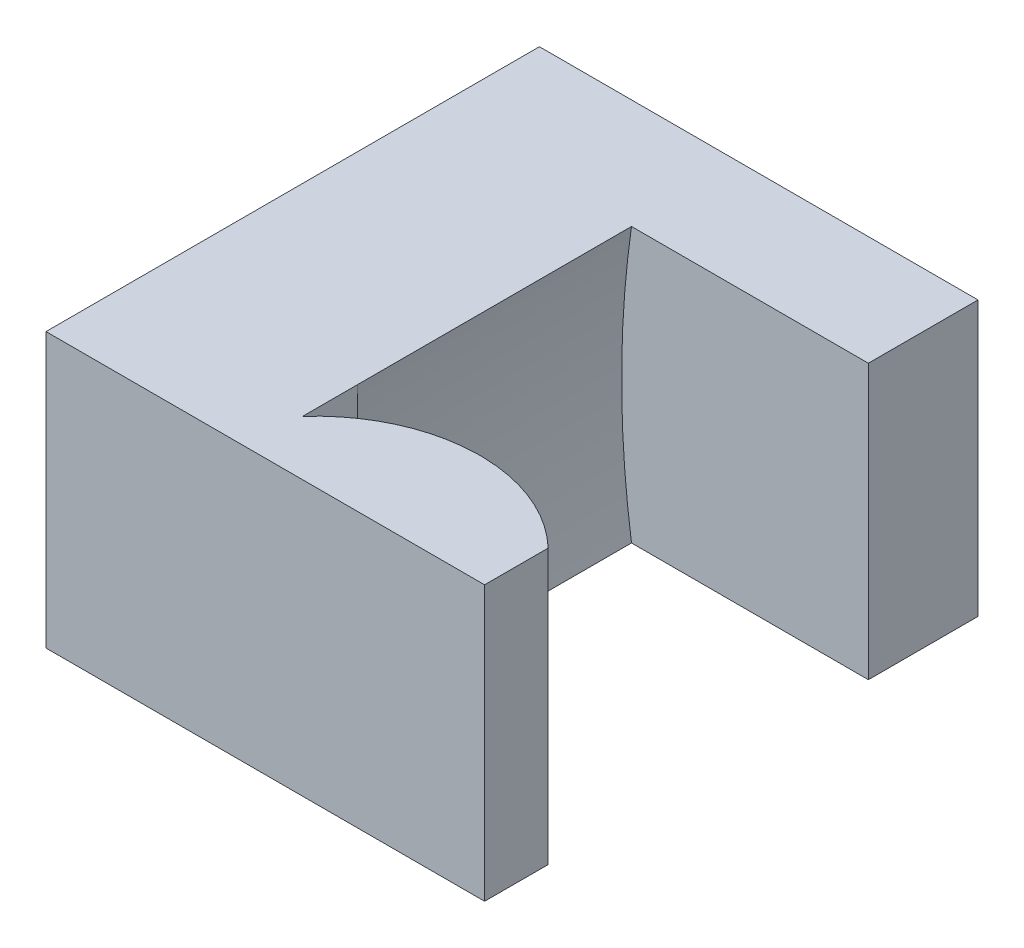
ISO-10303-21;
HEADER;
FILE_DESCRIPTION(('STEP AP214'),'2;1');
FILE_NAME('part.step','',(''),(''),'','','');
FILE_SCHEMA(('AUTOMOTIVE_DESIGN { 1 0 10303 214 1 1 1 1 }'));
ENDSEC;
DATA;
#1=APPLICATION_CONTEXT('core data for automotive mechanical design processes');
#2=APPLICATION_PROTOCOL_DEFINITION('international standard','automotive_design',2000,#1);
#3=PRODUCT_CONTEXT('',#1,'mechanical');
#4=PRODUCT('Part','Part','',(#3));
#5=PRODUCT_RELATED_PRODUCT_CATEGORY('part','',(#4));
#6=PRODUCT_DEFINITION_FORMATION('','',#4);
#7=PRODUCT_DEFINITION_CONTEXT('part definition',#1,'design');
#8=PRODUCT_DEFINITION('design','',#6,#7);
#9=PRODUCT_DEFINITION_SHAPE('','',#8);
#10=(LENGTH_UNIT() NAMED_UNIT(*) SI_UNIT(.MILLI.,.METRE.));
#11=(NAMED_UNIT(*) PLANE_ANGLE_UNIT() SI_UNIT($,.RADIAN.));
#12=(NAMED_UNIT(*) SI_UNIT($,.STERADIAN.) SOLID_ANGLE_UNIT());
#13=UNCERTAINTY_MEASURE_WITH_UNIT(LENGTH_MEASURE(1.E-05),#10,'distance_accuracy_value','');
#14=(GEOMETRIC_REPRESENTATION_CONTEXT(3) GLOBAL_UNCERTAINTY_ASSIGNED_CONTEXT((#13)) GLOBAL_UNIT_ASSIGNED_CONTEXT((#10,
#11,#12)) REPRESENTATION_CONTEXT('',''));
#15=CARTESIAN_POINT('',(0.,0.,0.));
#16=DIRECTION('',(0.,0.,1.));
#17=DIRECTION('',(1.,0.,0.));
#18=AXIS2_PLACEMENT_3D('',#15,#16,#17);
#19=CARTESIAN_POINT('',(0.,0.,0.));
#20=DIRECTION('',(0.,0.,-1.));
#21=DIRECTION('',(-1.,0.,0.));
#22=AXIS2_PLACEMENT_3D('',#19,#20,#21);
#23=PLANE('',#22);
#24=DIRECTION('',(1.,0.,0.));
#25=VECTOR('',#24,1.);
#26=CARTESIAN_POINT('',(-13.,-2.5,0.));
#27=LINE('',#26,#25);
#28=CARTESIAN_POINT('',(-15.1602540379917,-2.5,0.));
#29=VERTEX_POINT('',#28);
#30=CARTESIAN_POINT('',(-15.0068731437874,-2.5,0.));
#31=VERTEX_POINT('',#30);
#32=EDGE_CURVE('E141',#29,#31,#27,.T.);
#33=ORIENTED_EDGE('',*,*,#32,.F.);
#34=DIRECTION('',(0.,1.,0.));
#35=VECTOR('',#34,1.);
#36=CARTESIAN_POINT('',(-15.1602540379917,-2.5,0.));
#37=LINE('',#36,#35);
#38=CARTESIAN_POINT('',(-15.1602540379917,2.5,0.));
#39=VERTEX_POINT('',#38);
#40=EDGE_CURVE('E74',#29,#39,#37,.T.);
#41=ORIENTED_EDGE('',*,*,#40,.T.);
#42=DIRECTION('',(-1.,0.,0.));
#43=VECTOR('',#42,1.);
#44=CARTESIAN_POINT('',(-13.,2.5,0.));
#45=LINE('',#44,#43);
#46=CARTESIAN_POINT('',(-15.0068731437874,2.5,0.));
#47=VERTEX_POINT('',#46);
#48=EDGE_CURVE('E138',#47,#39,#45,.T.);
#49=ORIENTED_EDGE('',*,*,#48,.F.);
#50=DIRECTION('',(0.,1.,0.));
#51=VECTOR('',#50,1.);
#52=CARTESIAN_POINT('',(-15.0068731437874,-2.5,0.));
#53=LINE('',#52,#51);
#54=EDGE_CURVE('E126',#31,#47,#53,.T.);
#55=ORIENTED_EDGE('',*,*,#54,.F.);
#56=EDGE_LOOP('',(#33,#41,#49,#55));
#57=FACE_BOUND('',#56,.T.);
#58=ADVANCED_FACE('F35',(#57),#23,.T.);
#59=CARTESIAN_POINT('',(0.,0.,0.));
#60=DIRECTION('',(0.,0.,-1.));
#61=DIRECTION('',(-1.,0.,0.));
#62=AXIS2_PLACEMENT_3D('',#59,#60,#61);
#63=CIRCLE('',#62,17.5000000002915);
#64=CARTESIAN_POINT('',(-17.3205080759833,-2.5,0.));
#65=VERTEX_POINT('',#64);
#66=CARTESIAN_POINT('',(-17.3205080759833,2.49999999999999,0.));
#67=VERTEX_POINT('',#66);
#68=EDGE_CURVE('E142',#65,#67,#63,.T.);
#69=ORIENTED_EDGE('',*,*,#68,.T.);
#70=DIRECTION('',(0.,1.,0.));
#71=VECTOR('',#70,1.);
#72=CARTESIAN_POINT('',(-17.3205080759833,-2.5,0.));
#73=LINE('',#72,#71);
#74=EDGE_CURVE('E218',#65,#67,#73,.T.);
#75=ORIENTED_EDGE('',*,*,#74,.F.);
#76=EDGE_LOOP('',(#69,#75));
#77=FACE_BOUND('',#76,.T.);
#78=ADVANCED_FACE('F231',(#77),#23,.T.);
#79=CARTESIAN_POINT('',(-13.,2.5,2.));
#80=DIRECTION('',(0.,-1.,0.));
#81=DIRECTION('',(1.,0.,0.));
#82=AXIS2_PLACEMENT_3D('',#79,#80,#81);
#83=PLANE('',#82);
#84=CARTESIAN_POINT('',(-15.0835635908896,2.5,2.99901960235729));
#85=DIRECTION('',(0.,1.,0.));
#86=DIRECTION('',(-1.,0.,0.));
#87=AXIS2_PLACEMENT_3D('',#84,#85,#86);
#88=CIRCLE('',#87,3.);
#89=CARTESIAN_POINT('',(-17.3205080759833,2.5,1.));
#90=VERTEX_POINT('',#89);
#91=EDGE_CURVE('E39',#39,#90,#88,.T.);
#92=ORIENTED_EDGE('',*,*,#91,.T.);
#93=DIRECTION('',(0.,0.,1.));
#94=VECTOR('',#93,1.);
#95=CARTESIAN_POINT('',(-17.3205080759833,2.5,2.));
#96=LINE('',#95,#94);
#97=EDGE_CURVE('E71',#67,#90,#96,.T.);
#98=ORIENTED_EDGE('',*,*,#97,.F.);
#99=DIRECTION('',(0.,0.,1.));
#100=VECTOR('',#99,1.);
#101=CARTESIAN_POINT('',(-17.3205080759833,2.5,-11.2079514188582));
#102=LINE('',#101,#100);
#103=CARTESIAN_POINT('',(-17.3205080759833,2.5,-5.));
#104=VERTEX_POINT('',#103);
#105=EDGE_CURVE('E198',#104,#67,#102,.T.);
#106=ORIENTED_EDGE('',*,*,#105,.F.);
#107=DIRECTION('',(1.,0.,0.));
#108=VECTOR('',#107,1.);
#109=CARTESIAN_POINT('',(0.,2.5,-5.));
#110=LINE('',#109,#108);
#111=CARTESIAN_POINT('',(-13.,2.5,-5.));
#112=VERTEX_POINT('',#111);
#113=EDGE_CURVE('E140',#104,#112,#110,.T.);
#114=ORIENTED_EDGE('',*,*,#113,.T.);
#115=DIRECTION('',(0.,0.,1.));
#116=VECTOR('',#115,1.);
#117=CARTESIAN_POINT('',(-13.,2.5,-7.));
#118=LINE('',#117,#116);
#119=CARTESIAN_POINT('',(-13.,2.5,-7.));
#120=VERTEX_POINT('',#119);
#121=EDGE_CURVE('E179',#120,#112,#118,.T.);
#122=ORIENTED_EDGE('',*,*,#121,.F.);
#123=DIRECTION('',(1.,0.,0.));
#124=VECTOR('',#123,1.);
#125=CARTESIAN_POINT('',(0.,2.5,-7.));
#126=LINE('',#125,#124);
#127=CARTESIAN_POINT('',(-21.,2.5,-7.));
#128=VERTEX_POINT('',#127);
#129=EDGE_CURVE('E172',#128,#120,#126,.T.);
#130=ORIENTED_EDGE('',*,*,#129,.F.);
#131=DIRECTION('',(0.,0.,-1.));
#132=VECTOR('',#131,1.);
#133=CARTESIAN_POINT('',(-21.,2.5,2.));
#134=LINE('',#133,#132);
#135=CARTESIAN_POINT('',(-21.,2.5,2.));
#136=VERTEX_POINT('',#135);
#137=EDGE_CURVE('E45',#136,#128,#134,.T.);
#138=ORIENTED_EDGE('',*,*,#137,.F.);
#139=DIRECTION('',(-1.,0.,0.));
#140=VECTOR('',#139,1.);
#141=CARTESIAN_POINT('',(-13.,2.5,2.));
#142=LINE('',#141,#140);
#143=CARTESIAN_POINT('',(-13.,2.5,2.));
#144=VERTEX_POINT('',#143);
#145=EDGE_CURVE('E205',#144,#136,#142,.T.);
#146=ORIENTED_EDGE('',*,*,#145,.F.);
#147=DIRECTION('',(0.,0.,-1.));
#148=VECTOR('',#147,1.);
#149=CARTESIAN_POINT('',(-13.,2.5,2.));
#150=LINE('',#149,#148);
#151=CARTESIAN_POINT('',(-13.,2.5,0.840602876440034));
#152=VERTEX_POINT('',#151);
#153=EDGE_CURVE('E11',#144,#152,#150,.T.);
#154=ORIENTED_EDGE('',*,*,#153,.T.);
#155=CARTESIAN_POINT('',(-15.0835635908896,2.5,2.99901960235729));
#156=DIRECTION('',(0.,1.,0.));
#157=DIRECTION('',(-1.,0.,0.));
#158=AXIS2_PLACEMENT_3D('',#155,#156,#157);
#159=CIRCLE('',#158,3.);
#160=EDGE_CURVE('E122',#152,#47,#159,.T.);
#161=ORIENTED_EDGE('',*,*,#160,.T.);
#162=ORIENTED_EDGE('',*,*,#48,.T.);
#163=EDGE_LOOP('',(#92,#98,#106,#114,#122,#130,#138,#146,#154,#161,#162));
#164=FACE_BOUND('',#163,.T.);
#165=ADVANCED_FACE('F137',(#164),#83,.F.);
#166=CARTESIAN_POINT('',(-13.,-2.5,2.));
#167=DIRECTION('',(0.,1.,0.));
#168=DIRECTION('',(0.,0.,1.));
#169=AXIS2_PLACEMENT_3D('',#166,#167,#168);
#170=PLANE('',#169);
#171=CARTESIAN_POINT('',(-15.0835635908896,-2.5,2.99901960235729));
#172=DIRECTION('',(0.,1.,0.));
#173=DIRECTION('',(-1.,0.,0.));
#174=AXIS2_PLACEMENT_3D('',#171,#172,#173);
#175=CIRCLE('',#174,3.);
#176=CARTESIAN_POINT('',(-17.3205080759833,-2.5,1.));
#177=VERTEX_POINT('',#176);
#178=EDGE_CURVE('E223',#29,#177,#175,.T.);
#179=ORIENTED_EDGE('',*,*,#178,.F.);
#180=ORIENTED_EDGE('',*,*,#32,.T.);
#181=CARTESIAN_POINT('',(-15.0835635908896,-2.5,2.99901960235729));
#182=DIRECTION('',(0.,1.,0.));
#183=DIRECTION('',(-1.,0.,0.));
#184=AXIS2_PLACEMENT_3D('',#181,#182,#183);
#185=CIRCLE('',#184,3.);
#186=CARTESIAN_POINT('',(-13.,-2.5,0.840602876440034));
#187=VERTEX_POINT('',#186);
#188=EDGE_CURVE('E129',#187,#31,#185,.T.);
#189=ORIENTED_EDGE('',*,*,#188,.F.);
#190=DIRECTION('',(0.,0.,-1.));
#191=VECTOR('',#190,1.);
#192=CARTESIAN_POINT('',(-13.,-2.5,2.));
#193=LINE('',#192,#191);
#194=CARTESIAN_POINT('',(-13.,-2.5,2.));
#195=VERTEX_POINT('',#194);
#196=EDGE_CURVE('E153',#195,#187,#193,.T.);
#197=ORIENTED_EDGE('',*,*,#196,.F.);
#198=DIRECTION('',(1.,0.,0.));
#199=VECTOR('',#198,1.);
#200=CARTESIAN_POINT('',(-13.,-2.5,2.));
#201=LINE('',#200,#199);
#202=CARTESIAN_POINT('',(-21.,-2.5,2.));
#203=VERTEX_POINT('',#202);
#204=EDGE_CURVE('E150',#203,#195,#201,.T.);
#205=ORIENTED_EDGE('',*,*,#204,.F.);
#206=DIRECTION('',(0.,0.,-1.));
#207=VECTOR('',#206,1.);
#208=CARTESIAN_POINT('',(-21.,-2.5,2.));
#209=LINE('',#208,#207);
#210=CARTESIAN_POINT('',(-21.,-2.5,-7.));
#211=VERTEX_POINT('',#210);
#212=EDGE_CURVE('E156',#203,#211,#209,.T.);
#213=ORIENTED_EDGE('',*,*,#212,.T.);
#214=DIRECTION('',(-1.,0.,0.));
#215=VECTOR('',#214,1.);
#216=CARTESIAN_POINT('',(0.,-2.5,-7.));
#217=LINE('',#216,#215);
#218=CARTESIAN_POINT('',(-13.,-2.5,-7.));
#219=VERTEX_POINT('',#218);
#220=EDGE_CURVE('E175',#219,#211,#217,.T.);
#221=ORIENTED_EDGE('',*,*,#220,.F.);
#222=DIRECTION('',(0.,0.,1.));
#223=VECTOR('',#222,1.);
#224=CARTESIAN_POINT('',(-13.,-2.5,-7.));
#225=LINE('',#224,#223);
#226=CARTESIAN_POINT('',(-13.,-2.5,-5.));
#227=VERTEX_POINT('',#226);
#228=EDGE_CURVE('E176',#219,#227,#225,.T.);
#229=ORIENTED_EDGE('',*,*,#228,.T.);
#230=DIRECTION('',(-1.,0.,0.));
#231=VECTOR('',#230,1.);
#232=CARTESIAN_POINT('',(0.,-2.5,-5.));
#233=LINE('',#232,#231);
#234=CARTESIAN_POINT('',(-17.3205080759833,-2.5,-5.));
#235=VERTEX_POINT('',#234);
#236=EDGE_CURVE('E181',#227,#235,#233,.T.);
#237=ORIENTED_EDGE('',*,*,#236,.T.);
#238=DIRECTION('',(0.,0.,1.));
#239=VECTOR('',#238,1.);
#240=CARTESIAN_POINT('',(-17.3205080759833,-2.5,-11.2079514188582));
#241=LINE('',#240,#239);
#242=EDGE_CURVE('E147',#235,#65,#241,.T.);
#243=ORIENTED_EDGE('',*,*,#242,.T.);
#244=DIRECTION('',(0.,0.,-1.));
#245=VECTOR('',#244,1.);
#246=CARTESIAN_POINT('',(-17.3205080759833,-2.5,0.));
#247=LINE('',#246,#245);
#248=EDGE_CURVE('E220',#177,#65,#247,.T.);
#249=ORIENTED_EDGE('',*,*,#248,.F.);
#250=EDGE_LOOP('',(#179,#180,#189,#197,#205,#213,#221,#229,#237,#243,#249));
#251=FACE_BOUND('',#250,.T.);
#252=ADVANCED_FACE('F212',(#251),#170,.F.);
#253=CARTESIAN_POINT('',(-13.,2.5,2.));
#254=DIRECTION('',(-1.,0.,0.));
#255=DIRECTION('',(0.,0.,1.));
#256=AXIS2_PLACEMENT_3D('',#253,#254,#255);
#257=PLANE('',#256);
#258=DIRECTION('',(0.,1.,0.));
#259=VECTOR('',#258,1.);
#260=CARTESIAN_POINT('',(-13.,-2.5,0.840602876440034));
#261=LINE('',#260,#259);
#262=EDGE_CURVE('E133',#187,#152,#261,.T.);
#263=ORIENTED_EDGE('',*,*,#262,.T.);
#264=ORIENTED_EDGE('',*,*,#153,.F.);
#265=DIRECTION('',(0.,1.,0.));
#266=VECTOR('',#265,1.);
#267=CARTESIAN_POINT('',(-13.,2.5,2.));
#268=LINE('',#267,#266);
#269=EDGE_CURVE('E144',#195,#144,#268,.T.);
#270=ORIENTED_EDGE('',*,*,#269,.F.);
#271=ORIENTED_EDGE('',*,*,#196,.T.);
#272=EDGE_LOOP('',(#263,#264,#270,#271));
#273=FACE_BOUND('',#272,.T.);
#274=ADVANCED_FACE('F37',(#273),#257,.F.);
#275=CARTESIAN_POINT('',(-21.,2.5,2.));
#276=DIRECTION('',(1.,0.,0.));
#277=DIRECTION('',(0.,0.,-1.));
#278=AXIS2_PLACEMENT_3D('',#275,#276,#277);
#279=PLANE('',#278);
#280=ORIENTED_EDGE('',*,*,#137,.T.);
#281=DIRECTION('',(0.,1.,0.));
#282=VECTOR('',#281,1.);
#283=CARTESIAN_POINT('',(-21.,0.,-7.));
#284=LINE('',#283,#282);
#285=EDGE_CURVE('E165',#211,#128,#284,.T.);
#286=ORIENTED_EDGE('',*,*,#285,.F.);
#287=ORIENTED_EDGE('',*,*,#212,.F.);
#288=DIRECTION('',(0.,-1.,0.));
#289=VECTOR('',#288,1.);
#290=CARTESIAN_POINT('',(-21.,2.5,2.));
#291=LINE('',#290,#289);
#292=EDGE_CURVE('E166',#136,#203,#291,.T.);
#293=ORIENTED_EDGE('',*,*,#292,.F.);
#294=EDGE_LOOP('',(#280,#286,#287,#293));
#295=FACE_BOUND('',#294,.T.);
#296=ADVANCED_FACE('F163',(#295),#279,.F.);
#297=CARTESIAN_POINT('',(0.,0.,2.));
#298=DIRECTION('',(0.,0.,-1.));
#299=DIRECTION('',(-1.,0.,0.));
#300=AXIS2_PLACEMENT_3D('',#297,#298,#299);
#301=PLANE('',#300);
#302=ORIENTED_EDGE('',*,*,#269,.T.);
#303=ORIENTED_EDGE('',*,*,#145,.T.);
#304=ORIENTED_EDGE('',*,*,#292,.T.);
#305=ORIENTED_EDGE('',*,*,#204,.T.);
#306=EDGE_LOOP('',(#302,#303,#304,#305));
#307=FACE_BOUND('',#306,.T.);
#308=ADVANCED_FACE('F209',(#307),#301,.F.);
#309=CARTESIAN_POINT('',(0.,0.,-11.2079514188582));
#310=DIRECTION('',(0.,0.,1.));
#311=DIRECTION('',(1.,0.,0.));
#312=AXIS2_PLACEMENT_3D('',#309,#310,#311);
#313=CYLINDRICAL_SURFACE('',#312,17.5000000002915);
#314=ORIENTED_EDGE('',*,*,#242,.F.);
#315=CARTESIAN_POINT('',(0.,0.,-5.));
#316=DIRECTION('',(0.,0.,-1.));
#317=DIRECTION('',(-1.,0.,0.));
#318=AXIS2_PLACEMENT_3D('',#315,#316,#317);
#319=CIRCLE('',#318,17.5000000002915);
#320=EDGE_CURVE('E194',#235,#104,#319,.T.);
#321=ORIENTED_EDGE('',*,*,#320,.T.);
#322=ORIENTED_EDGE('',*,*,#105,.T.);
#323=ORIENTED_EDGE('',*,*,#68,.F.);
#324=EDGE_LOOP('',(#314,#321,#322,#323));
#325=FACE_BOUND('',#324,.T.);
#326=ADVANCED_FACE('F233',(#325),#313,.F.);
#327=CARTESIAN_POINT('',(0.,0.,-5.));
#328=DIRECTION('',(0.,0.,-1.));
#329=DIRECTION('',(-1.,0.,0.));
#330=AXIS2_PLACEMENT_3D('',#327,#328,#329);
#331=PLANE('',#330);
#332=ORIENTED_EDGE('',*,*,#320,.F.);
#333=ORIENTED_EDGE('',*,*,#236,.F.);
#334=DIRECTION('',(0.,-1.,0.));
#335=VECTOR('',#334,1.);
#336=CARTESIAN_POINT('',(-13.,0.,-5.));
#337=LINE('',#336,#335);
#338=EDGE_CURVE('E185',#112,#227,#337,.T.);
#339=ORIENTED_EDGE('',*,*,#338,.F.);
#340=ORIENTED_EDGE('',*,*,#113,.F.);
#341=EDGE_LOOP('',(#332,#333,#339,#340));
#342=FACE_BOUND('',#341,.T.);
#343=ADVANCED_FACE('F238',(#342),#331,.F.);
#344=CARTESIAN_POINT('',(-13.,0.,-7.));
#345=DIRECTION('',(-1.,0.,0.));
#346=DIRECTION('',(0.,0.,1.));
#347=AXIS2_PLACEMENT_3D('',#344,#345,#346);
#348=PLANE('',#347);
#349=ORIENTED_EDGE('',*,*,#338,.T.);
#350=ORIENTED_EDGE('',*,*,#228,.F.);
#351=DIRECTION('',(0.,-1.,0.));
#352=VECTOR('',#351,1.);
#353=CARTESIAN_POINT('',(-13.,0.,-7.));
#354=LINE('',#353,#352);
#355=EDGE_CURVE('E180',#120,#219,#354,.T.);
#356=ORIENTED_EDGE('',*,*,#355,.F.);
#357=ORIENTED_EDGE('',*,*,#121,.T.);
#358=EDGE_LOOP('',(#349,#350,#356,#357));
#359=FACE_BOUND('',#358,.T.);
#360=ADVANCED_FACE('F241',(#359),#348,.F.);
#361=CARTESIAN_POINT('',(0.,0.,-7.));
#362=DIRECTION('',(0.,0.,-1.));
#363=DIRECTION('',(-1.,0.,0.));
#364=AXIS2_PLACEMENT_3D('',#361,#362,#363);
#365=PLANE('',#364);
#366=ORIENTED_EDGE('',*,*,#129,.T.);
#367=ORIENTED_EDGE('',*,*,#355,.T.);
#368=ORIENTED_EDGE('',*,*,#220,.T.);
#369=ORIENTED_EDGE('',*,*,#285,.T.);
#370=EDGE_LOOP('',(#366,#367,#368,#369));
#371=FACE_BOUND('',#370,.T.);
#372=ADVANCED_FACE('F171',(#371),#365,.T.);
#373=CARTESIAN_POINT('',(-15.0835635908896,-2.5,2.99901960235729));
#374=DIRECTION('',(0.,1.,0.));
#375=DIRECTION('',(-1.,0.,0.));
#376=AXIS2_PLACEMENT_3D('',#373,#374,#375);
#377=CYLINDRICAL_SURFACE('',#376,3.);
#378=ORIENTED_EDGE('',*,*,#160,.F.);
#379=ORIENTED_EDGE('',*,*,#262,.F.);
#380=ORIENTED_EDGE('',*,*,#188,.T.);
#381=ORIENTED_EDGE('',*,*,#54,.T.);
#382=EDGE_LOOP('',(#378,#379,#380,#381));
#383=FACE_BOUND('',#382,.T.);
#384=ADVANCED_FACE('F127',(#383),#377,.T.);
#385=CARTESIAN_POINT('',(-15.0835635908896,-2.5,2.99901960235729));
#386=DIRECTION('',(0.,1.,0.));
#387=DIRECTION('',(-1.,0.,0.));
#388=AXIS2_PLACEMENT_3D('',#385,#386,#387);
#389=CYLINDRICAL_SURFACE('',#388,3.);
#390=ORIENTED_EDGE('',*,*,#91,.F.);
#391=ORIENTED_EDGE('',*,*,#40,.F.);
#392=ORIENTED_EDGE('',*,*,#178,.T.);
#393=DIRECTION('',(0.,1.,0.));
#394=VECTOR('',#393,1.);
#395=CARTESIAN_POINT('',(-17.3205080759833,-2.5,1.));
#396=LINE('',#395,#394);
#397=EDGE_CURVE('E54',#177,#90,#396,.T.);
#398=ORIENTED_EDGE('',*,*,#397,.T.);
#399=EDGE_LOOP('',(#390,#391,#392,#398));
#400=FACE_BOUND('',#399,.T.);
#401=ADVANCED_FACE('F225',(#400),#389,.T.);
#402=CARTESIAN_POINT('',(-17.3205080759833,-2.5,0.));
#403=DIRECTION('',(1.,0.,0.));
#404=DIRECTION('',(0.,1.,0.));
#405=AXIS2_PLACEMENT_3D('',#402,#403,#404);
#406=PLANE('',#405);
#407=ORIENTED_EDGE('',*,*,#97,.T.);
#408=ORIENTED_EDGE('',*,*,#397,.F.);
#409=ORIENTED_EDGE('',*,*,#248,.T.);
#410=ORIENTED_EDGE('',*,*,#74,.T.);
#411=EDGE_LOOP('',(#407,#408,#409,#410));
#412=FACE_BOUND('',#411,.T.);
#413=ADVANCED_FACE('F229',(#412),#406,.T.);
#414=CLOSED_SHELL('',(#58,#78,#165,#252,#274,#296,#308,#326,#343,#360,#372,#384,#401,#413));
#415=MANIFOLD_SOLID_BREP('B2',#414);
#416=ADVANCED_BREP_SHAPE_REPRESENTATION('',(#18,#415),#14);
#417=SHAPE_DEFINITION_REPRESENTATION(#9,#416);
ENDSEC;
END-ISO-10303-21;
